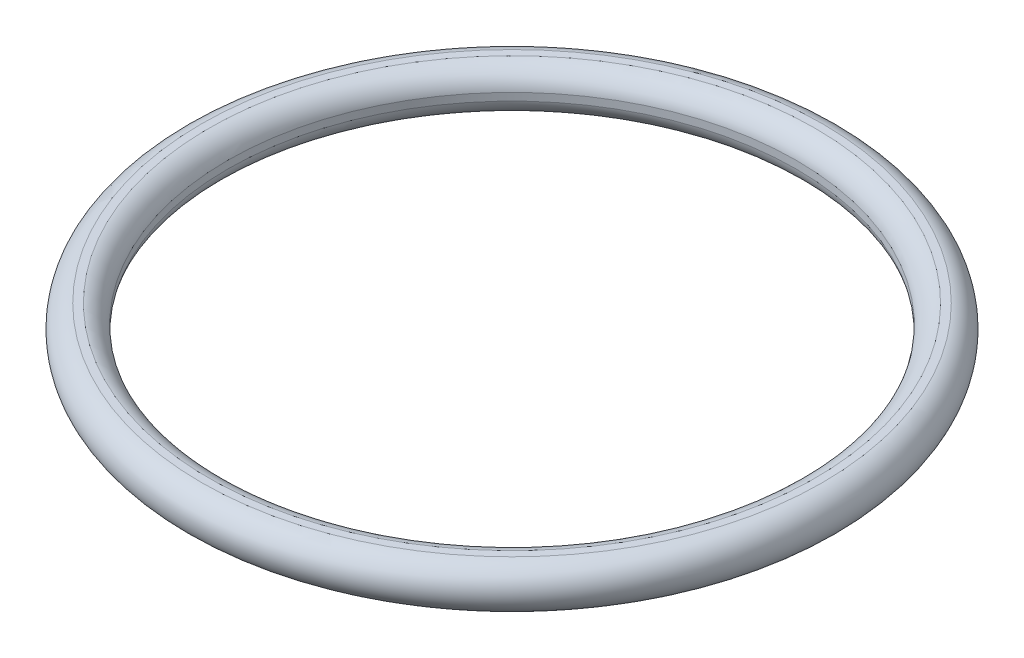
ISO-10303-21;
HEADER;
FILE_DESCRIPTION(('STEP AP214'),'2;1');
FILE_NAME('part.step','',(''),(''),'','','');
FILE_SCHEMA(('AUTOMOTIVE_DESIGN { 1 0 10303 214 1 1 1 1 }'));
ENDSEC;
DATA;
#1=APPLICATION_CONTEXT('core data for automotive mechanical design processes');
#2=APPLICATION_PROTOCOL_DEFINITION('international standard','automotive_design',2000,#1);
#3=PRODUCT_CONTEXT('',#1,'mechanical');
#4=PRODUCT('Part','Part','',(#3));
#5=PRODUCT_RELATED_PRODUCT_CATEGORY('part','',(#4));
#6=PRODUCT_DEFINITION_FORMATION('','',#4);
#7=PRODUCT_DEFINITION_CONTEXT('part definition',#1,'design');
#8=PRODUCT_DEFINITION('design','',#6,#7);
#9=PRODUCT_DEFINITION_SHAPE('','',#8);
#10=(LENGTH_UNIT() NAMED_UNIT(*) SI_UNIT(.MILLI.,.METRE.));
#11=(NAMED_UNIT(*) PLANE_ANGLE_UNIT() SI_UNIT($,.RADIAN.));
#12=(NAMED_UNIT(*) SI_UNIT($,.STERADIAN.) SOLID_ANGLE_UNIT());
#13=UNCERTAINTY_MEASURE_WITH_UNIT(LENGTH_MEASURE(1.E-05),#10,'distance_accuracy_value','');
#14=(GEOMETRIC_REPRESENTATION_CONTEXT(3) GLOBAL_UNCERTAINTY_ASSIGNED_CONTEXT((#13)) GLOBAL_UNIT_ASSIGNED_CONTEXT((#10,
#11,#12)) REPRESENTATION_CONTEXT('',''));
#15=CARTESIAN_POINT('',(0.,0.,0.));
#16=DIRECTION('',(0.,0.,1.));
#17=DIRECTION('',(1.,0.,0.));
#18=AXIS2_PLACEMENT_3D('',#15,#16,#17);
#19=CARTESIAN_POINT('',(0.,0.,0.));
#20=DIRECTION('',(0.,-1.,0.));
#21=DIRECTION('',(0.,0.,-1.));
#22=AXIS2_PLACEMENT_3D('',#19,#20,#21);
#23=TOROIDAL_SURFACE('',#22,10.15,0.75);
#24=CARTESIAN_POINT('',(0.,0.125,0.));
#25=DIRECTION('',(0.,-1.,0.));
#26=DIRECTION('',(0.,0.,-1.));
#27=AXIS2_PLACEMENT_3D('',#24,#25,#26);
#28=CIRCLE('',#27,9.41049002711255);
#29=CARTESIAN_POINT('',(0.,0.125,-9.41049002711255));
#30=VERTEX_POINT('',#29);
#31=EDGE_CURVE('E10',#30,#30,#28,.T.);
#32=ORIENTED_EDGE('',*,*,#31,.T.);
#33=EDGE_LOOP('',(#32));
#34=FACE_BOUND('',#33,.T.);
#35=CARTESIAN_POINT('',(0.,0.739509972887452,0.));
#36=DIRECTION('',(0.,-1.,0.));
#37=DIRECTION('',(0.,0.,-1.));
#38=AXIS2_PLACEMENT_3D('',#35,#36,#37);
#39=CIRCLE('',#38,10.025);
#40=CARTESIAN_POINT('',(0.,0.739509972887452,-10.025));
#41=VERTEX_POINT('',#40);
#42=EDGE_CURVE('E49',#41,#41,#39,.T.);
#43=ORIENTED_EDGE('',*,*,#42,.F.);
#44=EDGE_LOOP('',(#43));
#45=FACE_BOUND('',#44,.T.);
#46=ADVANCED_FACE('F35',(#34,#45),#23,.T.);
#47=CARTESIAN_POINT('',(0.,0.,0.));
#48=DIRECTION('',(0.,-1.,0.));
#49=DIRECTION('',(0.,0.,-1.));
#50=AXIS2_PLACEMENT_3D('',#47,#48,#49);
#51=CYLINDRICAL_SURFACE('',#50,9.41049002711255);
#52=CARTESIAN_POINT('',(0.,-0.125,0.));
#53=DIRECTION('',(0.,-1.,0.));
#54=DIRECTION('',(0.,0.,-1.));
#55=AXIS2_PLACEMENT_3D('',#52,#53,#54);
#56=CIRCLE('',#55,9.41049002711255);
#57=CARTESIAN_POINT('',(0.,-0.125,-9.41049002711255));
#58=VERTEX_POINT('',#57);
#59=EDGE_CURVE('E41',#58,#58,#56,.T.);
#60=ORIENTED_EDGE('',*,*,#59,.T.);
#61=EDGE_LOOP('',(#60));
#62=FACE_BOUND('',#61,.T.);
#63=ORIENTED_EDGE('',*,*,#31,.F.);
#64=EDGE_LOOP('',(#63));
#65=FACE_BOUND('',#64,.T.);
#66=ADVANCED_FACE('F59',(#62,#65),#51,.F.);
#67=CARTESIAN_POINT('',(0.,0.,0.));
#68=DIRECTION('',(0.,-1.,0.));
#69=DIRECTION('',(0.,0.,-1.));
#70=AXIS2_PLACEMENT_3D('',#67,#68,#69);
#71=TOROIDAL_SURFACE('',#70,10.15,0.75);
#72=CARTESIAN_POINT('',(0.,0.739509972887452,0.));
#73=DIRECTION('',(0.,-1.,0.));
#74=DIRECTION('',(0.,0.,-1.));
#75=AXIS2_PLACEMENT_3D('',#72,#73,#74);
#76=CIRCLE('',#75,10.275);
#77=CARTESIAN_POINT('',(0.,0.739509972887452,-10.275));
#78=VERTEX_POINT('',#77);
#79=EDGE_CURVE('E45',#78,#78,#76,.T.);
#80=ORIENTED_EDGE('',*,*,#79,.T.);
#81=EDGE_LOOP('',(#80));
#82=FACE_BOUND('',#81,.T.);
#83=ORIENTED_EDGE('',*,*,#59,.F.);
#84=EDGE_LOOP('',(#83));
#85=FACE_BOUND('',#84,.T.);
#86=ADVANCED_FACE('F63',(#82,#85),#71,.T.);
#87=CARTESIAN_POINT('',(10.025,0.739509972887452,0.));
#88=DIRECTION('',(0.,1.,0.));
#89=DIRECTION('',(0.,0.,1.));
#90=AXIS2_PLACEMENT_3D('',#87,#88,#89);
#91=PLANE('',#90);
#92=ORIENTED_EDGE('',*,*,#42,.T.);
#93=EDGE_LOOP('',(#92));
#94=FACE_BOUND('',#93,.T.);
#95=ORIENTED_EDGE('',*,*,#79,.F.);
#96=EDGE_LOOP('',(#95));
#97=FACE_BOUND('',#96,.T.);
#98=ADVANCED_FACE('F55',(#94,#97),#91,.T.);
#99=CLOSED_SHELL('',(#46,#66,#86,#98));
#100=MANIFOLD_SOLID_BREP('B2',#99);
#101=ADVANCED_BREP_SHAPE_REPRESENTATION('',(#18,#100),#14);
#102=SHAPE_DEFINITION_REPRESENTATION(#9,#101);
ENDSEC;
END-ISO-10303-21;
